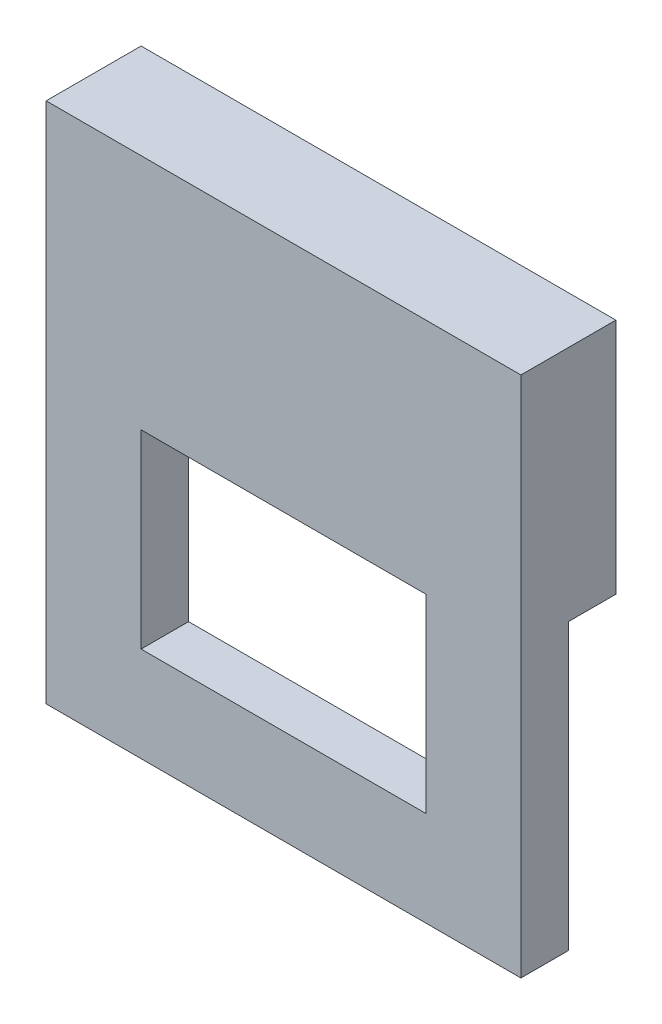
ISO-10303-21;
HEADER;
FILE_DESCRIPTION(('STEP AP214'),'2;1');
FILE_NAME('part.step','',(''),(''),'','','');
FILE_SCHEMA(('AUTOMOTIVE_DESIGN { 1 0 10303 214 1 1 1 1 }'));
ENDSEC;
DATA;
#1=APPLICATION_CONTEXT('core data for automotive mechanical design processes');
#2=APPLICATION_PROTOCOL_DEFINITION('international standard','automotive_design',2000,#1);
#3=PRODUCT_CONTEXT('',#1,'mechanical');
#4=PRODUCT('Part','Part','',(#3));
#5=PRODUCT_RELATED_PRODUCT_CATEGORY('part','',(#4));
#6=PRODUCT_DEFINITION_FORMATION('','',#4);
#7=PRODUCT_DEFINITION_CONTEXT('part definition',#1,'design');
#8=PRODUCT_DEFINITION('design','',#6,#7);
#9=PRODUCT_DEFINITION_SHAPE('','',#8);
#10=(LENGTH_UNIT() NAMED_UNIT(*) SI_UNIT(.MILLI.,.METRE.));
#11=(NAMED_UNIT(*) PLANE_ANGLE_UNIT() SI_UNIT($,.RADIAN.));
#12=(NAMED_UNIT(*) SI_UNIT($,.STERADIAN.) SOLID_ANGLE_UNIT());
#13=UNCERTAINTY_MEASURE_WITH_UNIT(LENGTH_MEASURE(1.E-05),#10,'distance_accuracy_value','');
#14=(GEOMETRIC_REPRESENTATION_CONTEXT(3) GLOBAL_UNCERTAINTY_ASSIGNED_CONTEXT((#13)) GLOBAL_UNIT_ASSIGNED_CONTEXT((#10,
#11,#12)) REPRESENTATION_CONTEXT('',''));
#15=CARTESIAN_POINT('',(0.,0.,0.));
#16=DIRECTION('',(0.,0.,1.));
#17=DIRECTION('',(1.,0.,0.));
#18=AXIS2_PLACEMENT_3D('',#15,#16,#17);
#19=CARTESIAN_POINT('',(5.,-6.,0.));
#20=DIRECTION('',(0.,0.,1.));
#21=DIRECTION('',(1.,0.,0.));
#22=AXIS2_PLACEMENT_3D('',#19,#20,#21);
#23=PLANE('',#22);
#24=DIRECTION('',(-1.,0.,0.));
#25=VECTOR('',#24,1.);
#26=CARTESIAN_POINT('',(5.,0.,0.));
#27=LINE('',#26,#25);
#28=CARTESIAN_POINT('',(-3.,0.,0.));
#29=VERTEX_POINT('',#28);
#30=CARTESIAN_POINT('',(-5.,0.,0.));
#31=VERTEX_POINT('',#30);
#32=EDGE_CURVE('E38',#29,#31,#27,.T.);
#33=ORIENTED_EDGE('',*,*,#32,.F.);
#34=DIRECTION('',(0.,-1.,0.));
#35=VECTOR('',#34,1.);
#36=CARTESIAN_POINT('',(-3.,-6.,0.));
#37=LINE('',#36,#35);
#38=CARTESIAN_POINT('',(-3.,-4.,0.));
#39=VERTEX_POINT('',#38);
#40=EDGE_CURVE('E137',#29,#39,#37,.T.);
#41=ORIENTED_EDGE('',*,*,#40,.T.);
#42=DIRECTION('',(1.,0.,0.));
#43=VECTOR('',#42,1.);
#44=CARTESIAN_POINT('',(5.,-4.,0.));
#45=LINE('',#44,#43);
#46=CARTESIAN_POINT('',(3.,-4.,0.));
#47=VERTEX_POINT('',#46);
#48=EDGE_CURVE('E132',#39,#47,#45,.T.);
#49=ORIENTED_EDGE('',*,*,#48,.T.);
#50=DIRECTION('',(0.,1.,0.));
#51=VECTOR('',#50,1.);
#52=CARTESIAN_POINT('',(3.,-6.,0.));
#53=LINE('',#52,#51);
#54=CARTESIAN_POINT('',(3.,0.,0.));
#55=VERTEX_POINT('',#54);
#56=EDGE_CURVE('E112',#47,#55,#53,.T.);
#57=ORIENTED_EDGE('',*,*,#56,.T.);
#58=CARTESIAN_POINT('',(5.,0.,0.));
#59=VERTEX_POINT('',#58);
#60=EDGE_CURVE('E11',#59,#55,#27,.T.);
#61=ORIENTED_EDGE('',*,*,#60,.F.);
#62=DIRECTION('',(0.,1.,0.));
#63=VECTOR('',#62,1.);
#64=CARTESIAN_POINT('',(5.,-6.,0.));
#65=LINE('',#64,#63);
#66=CARTESIAN_POINT('',(5.,-6.,0.));
#67=VERTEX_POINT('',#66);
#68=EDGE_CURVE('E141',#67,#59,#65,.T.);
#69=ORIENTED_EDGE('',*,*,#68,.F.);
#70=DIRECTION('',(-1.,0.,0.));
#71=VECTOR('',#70,1.);
#72=CARTESIAN_POINT('',(5.,-6.,0.));
#73=LINE('',#72,#71);
#74=CARTESIAN_POINT('',(-5.,-6.,0.));
#75=VERTEX_POINT('',#74);
#76=EDGE_CURVE('E155',#67,#75,#73,.T.);
#77=ORIENTED_EDGE('',*,*,#76,.T.);
#78=DIRECTION('',(0.,1.,0.));
#79=VECTOR('',#78,1.);
#80=CARTESIAN_POINT('',(-5.,-6.,0.));
#81=LINE('',#80,#79);
#82=EDGE_CURVE('E140',#75,#31,#81,.T.);
#83=ORIENTED_EDGE('',*,*,#82,.T.);
#84=EDGE_LOOP('',(#33,#41,#49,#57,#61,#69,#77,#83));
#85=FACE_BOUND('',#84,.T.);
#86=ADVANCED_FACE('F31',(#85),#23,.F.);
#87=CARTESIAN_POINT('',(5.,0.,0.));
#88=DIRECTION('',(0.,1.,0.));
#89=DIRECTION('',(0.,0.,1.));
#90=AXIS2_PLACEMENT_3D('',#87,#88,#89);
#91=PLANE('',#90);
#92=ORIENTED_EDGE('',*,*,#60,.T.);
#93=DIRECTION('',(0.,0.,1.));
#94=VECTOR('',#93,1.);
#95=CARTESIAN_POINT('',(3.,0.,-9.));
#96=LINE('',#95,#94);
#97=CARTESIAN_POINT('',(3.,0.,1.));
#98=VERTEX_POINT('',#97);
#99=EDGE_CURVE('E114',#55,#98,#96,.T.);
#100=ORIENTED_EDGE('',*,*,#99,.T.);
#101=DIRECTION('',(-1.,0.,0.));
#102=VECTOR('',#101,1.);
#103=CARTESIAN_POINT('',(-3.,0.,1.));
#104=LINE('',#103,#102);
#105=CARTESIAN_POINT('',(-3.,0.,1.));
#106=VERTEX_POINT('',#105);
#107=EDGE_CURVE('E125',#98,#106,#104,.T.);
#108=ORIENTED_EDGE('',*,*,#107,.T.);
#109=DIRECTION('',(0.,0.,1.));
#110=VECTOR('',#109,1.);
#111=CARTESIAN_POINT('',(-3.,0.,-9.));
#112=LINE('',#111,#110);
#113=EDGE_CURVE('E130',#29,#106,#112,.T.);
#114=ORIENTED_EDGE('',*,*,#113,.F.);
#115=ORIENTED_EDGE('',*,*,#32,.T.);
#116=DIRECTION('',(0.,0.,-1.));
#117=VECTOR('',#116,1.);
#118=CARTESIAN_POINT('',(-5.,0.,0.));
#119=LINE('',#118,#117);
#120=CARTESIAN_POINT('',(-5.,0.,-1.));
#121=VERTEX_POINT('',#120);
#122=EDGE_CURVE('E158',#31,#121,#119,.T.);
#123=ORIENTED_EDGE('',*,*,#122,.T.);
#124=DIRECTION('',(-1.,0.,0.));
#125=VECTOR('',#124,1.);
#126=CARTESIAN_POINT('',(5.,0.,-1.));
#127=LINE('',#126,#125);
#128=CARTESIAN_POINT('',(5.,0.,-1.));
#129=VERTEX_POINT('',#128);
#130=EDGE_CURVE('E178',#129,#121,#127,.T.);
#131=ORIENTED_EDGE('',*,*,#130,.F.);
#132=DIRECTION('',(0.,0.,-1.));
#133=VECTOR('',#132,1.);
#134=CARTESIAN_POINT('',(5.,0.,0.));
#135=LINE('',#134,#133);
#136=EDGE_CURVE('E144',#59,#129,#135,.T.);
#137=ORIENTED_EDGE('',*,*,#136,.F.);
#138=EDGE_LOOP('',(#92,#100,#108,#114,#115,#123,#131,#137));
#139=FACE_BOUND('',#138,.T.);
#140=ADVANCED_FACE('F186',(#139),#91,.F.);
#141=CARTESIAN_POINT('',(5.,0.,-1.));
#142=DIRECTION('',(0.,0.,1.));
#143=DIRECTION('',(1.,0.,0.));
#144=AXIS2_PLACEMENT_3D('',#141,#142,#143);
#145=PLANE('',#144);
#146=DIRECTION('',(0.,1.,0.));
#147=VECTOR('',#146,1.);
#148=CARTESIAN_POINT('',(-5.,0.,-1.));
#149=LINE('',#148,#147);
#150=CARTESIAN_POINT('',(-5.,5.,-1.));
#151=VERTEX_POINT('',#150);
#152=EDGE_CURVE('E161',#121,#151,#149,.T.);
#153=ORIENTED_EDGE('',*,*,#152,.T.);
#154=DIRECTION('',(-1.,0.,0.));
#155=VECTOR('',#154,1.);
#156=CARTESIAN_POINT('',(5.,5.,-1.));
#157=LINE('',#156,#155);
#158=CARTESIAN_POINT('',(5.,5.,-1.));
#159=VERTEX_POINT('',#158);
#160=EDGE_CURVE('E176',#159,#151,#157,.T.);
#161=ORIENTED_EDGE('',*,*,#160,.F.);
#162=DIRECTION('',(0.,1.,0.));
#163=VECTOR('',#162,1.);
#164=CARTESIAN_POINT('',(5.,0.,-1.));
#165=LINE('',#164,#163);
#166=EDGE_CURVE('E147',#129,#159,#165,.T.);
#167=ORIENTED_EDGE('',*,*,#166,.F.);
#168=ORIENTED_EDGE('',*,*,#130,.T.);
#169=EDGE_LOOP('',(#153,#161,#167,#168));
#170=FACE_BOUND('',#169,.T.);
#171=ADVANCED_FACE('F208',(#170),#145,.F.);
#172=CARTESIAN_POINT('',(5.,5.,-1.));
#173=DIRECTION('',(0.,-1.,0.));
#174=DIRECTION('',(0.,0.,-1.));
#175=AXIS2_PLACEMENT_3D('',#172,#173,#174);
#176=PLANE('',#175);
#177=DIRECTION('',(0.,0.,1.));
#178=VECTOR('',#177,1.);
#179=CARTESIAN_POINT('',(-5.,5.,-1.));
#180=LINE('',#179,#178);
#181=CARTESIAN_POINT('',(-5.,5.,1.));
#182=VERTEX_POINT('',#181);
#183=EDGE_CURVE('E163',#151,#182,#180,.T.);
#184=ORIENTED_EDGE('',*,*,#183,.T.);
#185=DIRECTION('',(-1.,0.,0.));
#186=VECTOR('',#185,1.);
#187=CARTESIAN_POINT('',(5.,5.,1.));
#188=LINE('',#187,#186);
#189=CARTESIAN_POINT('',(5.,5.,1.));
#190=VERTEX_POINT('',#189);
#191=EDGE_CURVE('E173',#190,#182,#188,.T.);
#192=ORIENTED_EDGE('',*,*,#191,.F.);
#193=DIRECTION('',(0.,0.,1.));
#194=VECTOR('',#193,1.);
#195=CARTESIAN_POINT('',(5.,5.,-1.));
#196=LINE('',#195,#194);
#197=EDGE_CURVE('E149',#159,#190,#196,.T.);
#198=ORIENTED_EDGE('',*,*,#197,.F.);
#199=ORIENTED_EDGE('',*,*,#160,.T.);
#200=EDGE_LOOP('',(#184,#192,#198,#199));
#201=FACE_BOUND('',#200,.T.);
#202=ADVANCED_FACE('F206',(#201),#176,.F.);
#203=CARTESIAN_POINT('',(5.,5.,1.));
#204=DIRECTION('',(0.,0.,-1.));
#205=DIRECTION('',(0.,1.,0.));
#206=AXIS2_PLACEMENT_3D('',#203,#204,#205);
#207=PLANE('',#206);
#208=DIRECTION('',(1.,0.,0.));
#209=VECTOR('',#208,1.);
#210=CARTESIAN_POINT('',(-3.,-4.,1.));
#211=LINE('',#210,#209);
#212=CARTESIAN_POINT('',(-3.,-4.,1.));
#213=VERTEX_POINT('',#212);
#214=CARTESIAN_POINT('',(3.,-4.,1.));
#215=VERTEX_POINT('',#214);
#216=EDGE_CURVE('E118',#213,#215,#211,.T.);
#217=ORIENTED_EDGE('',*,*,#216,.F.);
#218=DIRECTION('',(0.,-1.,0.));
#219=VECTOR('',#218,1.);
#220=CARTESIAN_POINT('',(-3.,0.,1.));
#221=LINE('',#220,#219);
#222=EDGE_CURVE('E53',#106,#213,#221,.T.);
#223=ORIENTED_EDGE('',*,*,#222,.F.);
#224=ORIENTED_EDGE('',*,*,#107,.F.);
#225=DIRECTION('',(0.,1.,0.));
#226=VECTOR('',#225,1.);
#227=CARTESIAN_POINT('',(3.,0.,1.));
#228=LINE('',#227,#226);
#229=EDGE_CURVE('E109',#215,#98,#228,.T.);
#230=ORIENTED_EDGE('',*,*,#229,.F.);
#231=EDGE_LOOP('',(#217,#223,#224,#230));
#232=FACE_BOUND('',#231,.T.);
#233=DIRECTION('',(0.,-1.,0.));
#234=VECTOR('',#233,1.);
#235=CARTESIAN_POINT('',(-5.,5.,1.));
#236=LINE('',#235,#234);
#237=CARTESIAN_POINT('',(-5.,-6.,1.));
#238=VERTEX_POINT('',#237);
#239=EDGE_CURVE('E165',#182,#238,#236,.T.);
#240=ORIENTED_EDGE('',*,*,#239,.T.);
#241=DIRECTION('',(-1.,0.,0.));
#242=VECTOR('',#241,1.);
#243=CARTESIAN_POINT('',(5.,-6.,1.));
#244=LINE('',#243,#242);
#245=CARTESIAN_POINT('',(5.,-6.,1.));
#246=VERTEX_POINT('',#245);
#247=EDGE_CURVE('E170',#246,#238,#244,.T.);
#248=ORIENTED_EDGE('',*,*,#247,.F.);
#249=DIRECTION('',(0.,-1.,0.));
#250=VECTOR('',#249,1.);
#251=CARTESIAN_POINT('',(5.,5.,1.));
#252=LINE('',#251,#250);
#253=EDGE_CURVE('E151',#190,#246,#252,.T.);
#254=ORIENTED_EDGE('',*,*,#253,.F.);
#255=ORIENTED_EDGE('',*,*,#191,.T.);
#256=EDGE_LOOP('',(#240,#248,#254,#255));
#257=FACE_BOUND('',#256,.T.);
#258=ADVANCED_FACE('F122',(#232,#257),#207,.F.);
#259=CARTESIAN_POINT('',(5.,-6.,1.));
#260=DIRECTION('',(0.,1.,0.));
#261=DIRECTION('',(0.,0.,1.));
#262=AXIS2_PLACEMENT_3D('',#259,#260,#261);
#263=PLANE('',#262);
#264=DIRECTION('',(0.,0.,-1.));
#265=VECTOR('',#264,1.);
#266=CARTESIAN_POINT('',(-5.,-6.,1.));
#267=LINE('',#266,#265);
#268=EDGE_CURVE('E145',#238,#75,#267,.T.);
#269=ORIENTED_EDGE('',*,*,#268,.T.);
#270=ORIENTED_EDGE('',*,*,#76,.F.);
#271=DIRECTION('',(0.,0.,-1.));
#272=VECTOR('',#271,1.);
#273=CARTESIAN_POINT('',(5.,-6.,1.));
#274=LINE('',#273,#272);
#275=EDGE_CURVE('E153',#246,#67,#274,.T.);
#276=ORIENTED_EDGE('',*,*,#275,.F.);
#277=ORIENTED_EDGE('',*,*,#247,.T.);
#278=EDGE_LOOP('',(#269,#270,#276,#277));
#279=FACE_BOUND('',#278,.T.);
#280=ADVANCED_FACE('F199',(#279),#263,.F.);
#281=CARTESIAN_POINT('',(5.,0.,0.));
#282=DIRECTION('',(-1.,0.,0.));
#283=DIRECTION('',(0.,0.,1.));
#284=AXIS2_PLACEMENT_3D('',#281,#282,#283);
#285=PLANE('',#284);
#286=ORIENTED_EDGE('',*,*,#68,.T.);
#287=ORIENTED_EDGE('',*,*,#136,.T.);
#288=ORIENTED_EDGE('',*,*,#166,.T.);
#289=ORIENTED_EDGE('',*,*,#197,.T.);
#290=ORIENTED_EDGE('',*,*,#253,.T.);
#291=ORIENTED_EDGE('',*,*,#275,.T.);
#292=EDGE_LOOP('',(#286,#287,#288,#289,#290,#291));
#293=FACE_BOUND('',#292,.T.);
#294=ADVANCED_FACE('F210',(#293),#285,.F.);
#295=CARTESIAN_POINT('',(-5.,0.,0.));
#296=DIRECTION('',(-1.,0.,0.));
#297=DIRECTION('',(0.,0.,1.));
#298=AXIS2_PLACEMENT_3D('',#295,#296,#297);
#299=PLANE('',#298);
#300=ORIENTED_EDGE('',*,*,#82,.F.);
#301=ORIENTED_EDGE('',*,*,#268,.F.);
#302=ORIENTED_EDGE('',*,*,#239,.F.);
#303=ORIENTED_EDGE('',*,*,#183,.F.);
#304=ORIENTED_EDGE('',*,*,#152,.F.);
#305=ORIENTED_EDGE('',*,*,#122,.F.);
#306=EDGE_LOOP('',(#300,#301,#302,#303,#304,#305));
#307=FACE_BOUND('',#306,.T.);
#308=ADVANCED_FACE('F191',(#307),#299,.T.);
#309=CARTESIAN_POINT('',(-3.,0.,-9.));
#310=DIRECTION('',(-1.,0.,0.));
#311=DIRECTION('',(0.,-1.,0.));
#312=AXIS2_PLACEMENT_3D('',#309,#310,#311);
#313=PLANE('',#312);
#314=ORIENTED_EDGE('',*,*,#113,.T.);
#315=ORIENTED_EDGE('',*,*,#222,.T.);
#316=DIRECTION('',(0.,0.,1.));
#317=VECTOR('',#316,1.);
#318=CARTESIAN_POINT('',(-3.,-4.,-9.));
#319=LINE('',#318,#317);
#320=EDGE_CURVE('E115',#39,#213,#319,.T.);
#321=ORIENTED_EDGE('',*,*,#320,.F.);
#322=ORIENTED_EDGE('',*,*,#40,.F.);
#323=EDGE_LOOP('',(#314,#315,#321,#322));
#324=FACE_BOUND('',#323,.T.);
#325=ADVANCED_FACE('F211',(#324),#313,.F.);
#326=CARTESIAN_POINT('',(3.,0.,-9.));
#327=DIRECTION('',(1.,0.,0.));
#328=DIRECTION('',(0.,1.,0.));
#329=AXIS2_PLACEMENT_3D('',#326,#327,#328);
#330=PLANE('',#329);
#331=DIRECTION('',(0.,0.,1.));
#332=VECTOR('',#331,1.);
#333=CARTESIAN_POINT('',(3.,-4.,-9.));
#334=LINE('',#333,#332);
#335=EDGE_CURVE('E45',#47,#215,#334,.T.);
#336=ORIENTED_EDGE('',*,*,#335,.T.);
#337=ORIENTED_EDGE('',*,*,#229,.T.);
#338=ORIENTED_EDGE('',*,*,#99,.F.);
#339=ORIENTED_EDGE('',*,*,#56,.F.);
#340=EDGE_LOOP('',(#336,#337,#338,#339));
#341=FACE_BOUND('',#340,.T.);
#342=ADVANCED_FACE('F107',(#341),#330,.F.);
#343=CARTESIAN_POINT('',(-3.,-4.,-9.));
#344=DIRECTION('',(0.,-1.,0.));
#345=DIRECTION('',(0.,0.,-1.));
#346=AXIS2_PLACEMENT_3D('',#343,#344,#345);
#347=PLANE('',#346);
#348=ORIENTED_EDGE('',*,*,#320,.T.);
#349=ORIENTED_EDGE('',*,*,#216,.T.);
#350=ORIENTED_EDGE('',*,*,#335,.F.);
#351=ORIENTED_EDGE('',*,*,#48,.F.);
#352=EDGE_LOOP('',(#348,#349,#350,#351));
#353=FACE_BOUND('',#352,.T.);
#354=ADVANCED_FACE('F119',(#353),#347,.F.);
#355=CLOSED_SHELL('',(#86,#140,#171,#202,#258,#280,#294,#308,#325,#342,#354));
#356=MANIFOLD_SOLID_BREP('B2',#355);
#357=ADVANCED_BREP_SHAPE_REPRESENTATION('',(#18,#356),#14);
#358=SHAPE_DEFINITION_REPRESENTATION(#9,#357);
ENDSEC;
END-ISO-10303-21;
